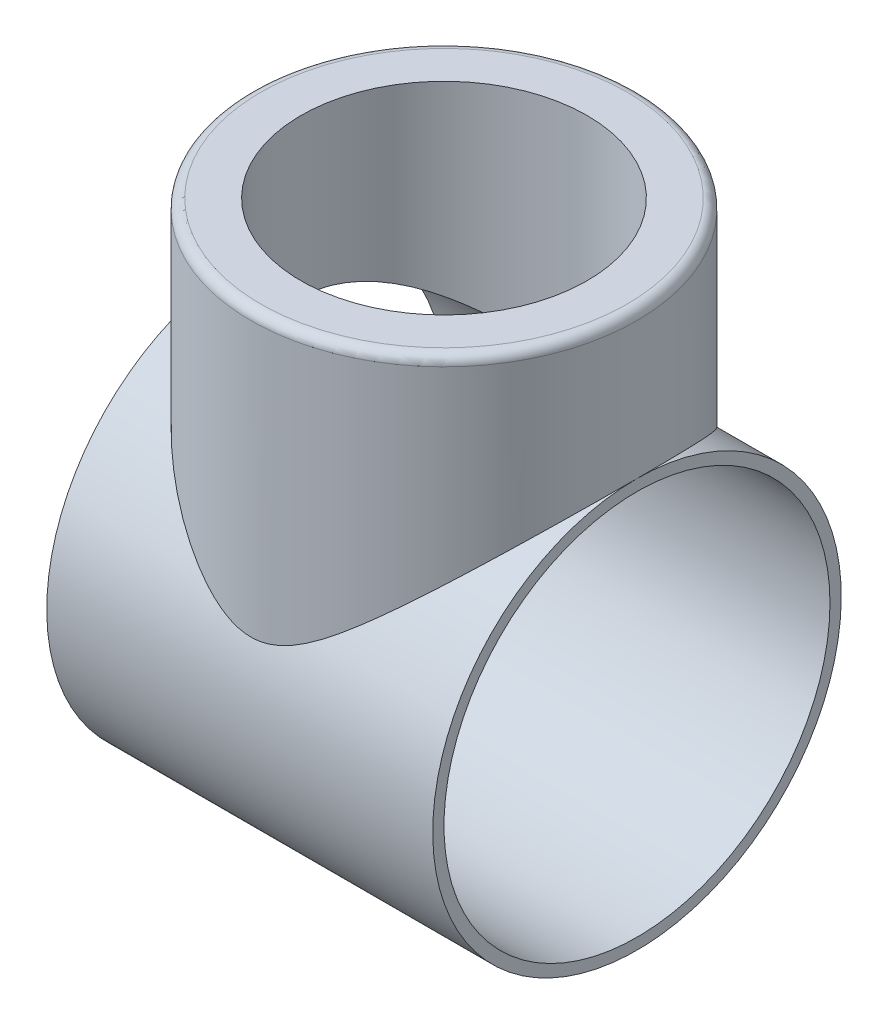
ISO-10303-21;
HEADER;
FILE_DESCRIPTION(('STEP AP214'),'2;1');
FILE_NAME('part.step','',(''),(''),'','','');
FILE_SCHEMA(('AUTOMOTIVE_DESIGN { 1 0 10303 214 1 1 1 1 }'));
ENDSEC;
DATA;
#1=APPLICATION_CONTEXT('core data for automotive mechanical design processes');
#2=APPLICATION_PROTOCOL_DEFINITION('international standard','automotive_design',2000,#1);
#3=PRODUCT_CONTEXT('',#1,'mechanical');
#4=PRODUCT('Part','Part','',(#3));
#5=PRODUCT_RELATED_PRODUCT_CATEGORY('part','',(#4));
#6=PRODUCT_DEFINITION_FORMATION('','',#4);
#7=PRODUCT_DEFINITION_CONTEXT('part definition',#1,'design');
#8=PRODUCT_DEFINITION('design','',#6,#7);
#9=PRODUCT_DEFINITION_SHAPE('','',#8);
#10=(LENGTH_UNIT() NAMED_UNIT(*) SI_UNIT(.MILLI.,.METRE.));
#11=(NAMED_UNIT(*) PLANE_ANGLE_UNIT() SI_UNIT($,.RADIAN.));
#12=(NAMED_UNIT(*) SI_UNIT($,.STERADIAN.) SOLID_ANGLE_UNIT());
#13=UNCERTAINTY_MEASURE_WITH_UNIT(LENGTH_MEASURE(1.E-05),#10,'distance_accuracy_value','');
#14=(GEOMETRIC_REPRESENTATION_CONTEXT(3) GLOBAL_UNCERTAINTY_ASSIGNED_CONTEXT((#13)) GLOBAL_UNIT_ASSIGNED_CONTEXT((#10,
#11,#12)) REPRESENTATION_CONTEXT('',''));
#15=CARTESIAN_POINT('',(0.,0.,0.));
#16=DIRECTION('',(0.,0.,1.));
#17=DIRECTION('',(1.,0.,0.));
#18=AXIS2_PLACEMENT_3D('',#15,#16,#17);
#19=CARTESIAN_POINT('',(-60.,0.,0.));
#20=DIRECTION('',(1.,0.,0.));
#21=DIRECTION('',(0.,0.,-1.));
#22=AXIS2_PLACEMENT_3D('',#19,#20,#21);
#23=CYLINDRICAL_SURFACE('',#22,60.);
#24=CARTESIAN_POINT('',(60.,0.,0.));
#25=DIRECTION('',(1.,0.,0.));
#26=DIRECTION('',(0.,0.,-1.));
#27=AXIS2_PLACEMENT_3D('',#24,#25,#26);
#28=CIRCLE('',#27,60.);
#29=CARTESIAN_POINT('',(60.,0.,-60.));
#30=VERTEX_POINT('',#29);
#31=EDGE_CURVE('E52',#30,#30,#28,.T.);
#32=ORIENTED_EDGE('',*,*,#31,.T.);
#33=EDGE_LOOP('',(#32));
#34=FACE_BOUND('',#33,.T.);
#35=CARTESIAN_POINT('',(-60.,0.,0.));
#36=DIRECTION('',(1.,0.,0.));
#37=DIRECTION('',(0.,0.,-1.));
#38=AXIS2_PLACEMENT_3D('',#35,#36,#37);
#39=CIRCLE('',#38,60.);
#40=CARTESIAN_POINT('',(-60.,0.,-60.));
#41=VERTEX_POINT('',#40);
#42=EDGE_CURVE('E93',#41,#41,#39,.T.);
#43=ORIENTED_EDGE('',*,*,#42,.F.);
#44=EDGE_LOOP('',(#43));
#45=FACE_BOUND('',#44,.T.);
#46=CARTESIAN_POINT('',(0.,40.2461178252015,-44.5));
#47=CARTESIAN_POINT('',(0.521950340710105,40.2461091874401,-44.5000042882494));
#48=CARTESIAN_POINT('',(1.04383948497891,40.2562813467974,-44.4908134860222));
#49=CARTESIAN_POINT('',(2.08624468800879,40.29679076695,-44.4541277588759));
#50=CARTESIAN_POINT('',(2.60676066855394,40.3271291525426,-44.4266318129637));
#51=CARTESIAN_POINT('',(3.64504853630487,40.4075295655595,-44.353517329002));
#52=CARTESIAN_POINT('',(4.16282007227801,40.4575940585679,-44.3078965255041));
#53=CARTESIAN_POINT('',(5.19431452475009,40.5766947814115,-44.1988491619566));
#54=CARTESIAN_POINT('',(5.70803686242041,40.6457336747779,-44.1354201020462));
#55=CARTESIAN_POINT('',(7.24359513295137,40.8802693471307,-43.9186705620038));
#56=CARTESIAN_POINT('',(8.25776608674282,41.0730198952663,-43.7390345051422));
#57=CARTESIAN_POINT('',(10.257564643931,41.5212745320888,-43.3137226483211));
#58=CARTESIAN_POINT('',(11.2431912015059,41.7767809168073,-43.068044432063));
#59=CARTESIAN_POINT('',(13.1683910438996,42.3357936145265,-42.5186066248349));
#60=CARTESIAN_POINT('',(14.1084079437203,42.6386010337178,-42.2156810096681));
#61=CARTESIAN_POINT('',(15.9539269275721,43.2842945061565,-41.5533826240879));
#62=CARTESIAN_POINT('',(16.8594298899541,43.627179538558,-41.1940112913641));
#63=CARTESIAN_POINT('',(18.6345171116782,44.3433852758225,-40.4220393745185));
#64=CARTESIAN_POINT('',(19.5041118289542,44.7166970236494,-40.009454434771));
#65=CARTESIAN_POINT('',(21.2071478906121,45.4853354810806,-39.1334121551078));
#66=CARTESIAN_POINT('',(22.0405865870086,45.8806637983028,-38.6699510978862));
#67=CARTESIAN_POINT('',(23.8366942513597,46.767617311318,-37.5948011891203));
#68=CARTESIAN_POINT('',(24.7912022086411,47.2624844601025,-36.9721303467494));
#69=CARTESIAN_POINT('',(26.6465675245206,48.261565680328,-35.6581377576236));
#70=CARTESIAN_POINT('',(27.5474205383753,48.7657805043797,-34.9668104634265));
#71=CARTESIAN_POINT('',(29.2952372557201,49.7739969690618,-33.5161235927462));
#72=CARTESIAN_POINT('',(30.1421256550589,50.2779973773472,-32.756672361943));
#73=CARTESIAN_POINT('',(31.778415864999,51.275700055055,-31.1717762181585));
#74=CARTESIAN_POINT('',(32.5678130326399,51.7694014904457,-30.346325986402));
#75=CARTESIAN_POINT('',(34.2360957924212,52.8334127397948,-28.4608944512654));
#76=CARTESIAN_POINT('',(35.1017938682631,53.3995579491807,-27.3868198685674));
#77=CARTESIAN_POINT('',(36.7388816469887,54.4896567975256,-25.1480955787368));
#78=CARTESIAN_POINT('',(37.5102508272926,55.0136012466809,-23.9834262512978));
#79=CARTESIAN_POINT('',(38.5884296851264,55.7561611927072,-22.1737546625714));
#80=CARTESIAN_POINT('',(38.9344445874246,55.996289592825,-21.5605741567996));
#81=CARTESIAN_POINT('',(39.5992657729467,56.4605628572466,-20.3137179214327));
#82=CARTESIAN_POINT('',(39.9180737273749,56.6847087031497,-19.6800434539945));
#83=CARTESIAN_POINT('',(40.5269396885394,57.1151163559301,-18.3935670488333));
#84=CARTESIAN_POINT('',(40.8170136671901,57.3213880901394,-17.7407760015974));
#85=CARTESIAN_POINT('',(41.367283893526,57.7145139820236,-16.4168180955821));
#86=CARTESIAN_POINT('',(41.6274729718284,57.9013634792897,-15.7456468750289));
#87=CARTESIAN_POINT('',(42.2160536104265,58.3257078564334,-14.1098261539199));
#88=CARTESIAN_POINT('',(42.5291096534308,58.5528683078576,-13.1368990351965));
#89=CARTESIAN_POINT('',(43.0893465453492,58.9610459401474,-11.1628943464204));
#90=CARTESIAN_POINT('',(43.336542803193,59.1420739139977,-10.1618234217544));
#91=CARTESIAN_POINT('',(43.6554372000947,59.3762755689208,-8.6440871772517));
#92=CARTESIAN_POINT('',(43.7530730054295,59.4481102596546,-8.13557560487839));
#93=CARTESIAN_POINT('',(43.9307501982228,59.5789994743003,-7.11392105689515));
#94=CARTESIAN_POINT('',(44.0107948440874,59.6380563650094,-6.60077895735988));
#95=CARTESIAN_POINT('',(44.1530120978249,59.7430847523843,-5.57062792558039));
#96=CARTESIAN_POINT('',(44.2151826797549,59.7890547657069,-5.05361856180834));
#97=CARTESIAN_POINT('',(44.3214117367221,59.8676564997752,-4.01674246446689));
#98=CARTESIAN_POINT('',(44.3654693389796,59.9002875777797,-3.49687559443048));
#99=CARTESIAN_POINT('',(44.4703501236668,59.9779923563319,-1.9318670440071));
#100=CARTESIAN_POINT('',(44.5035602840376,60.0026399674937,-0.88363602968756));
#101=CARTESIAN_POINT('',(44.4958330595716,59.9969100963708,1.21224592845824));
#102=CARTESIAN_POINT('',(44.4548959647422,59.9665328293014,2.25989687453725));
#103=CARTESIAN_POINT('',(44.2995376296408,59.8514519760434,4.34695695359885));
#104=CARTESIAN_POINT('',(44.1851013218437,59.7667372505429,5.38636435239261));
#105=CARTESIAN_POINT('',(43.8844904701222,59.5448422310987,7.44901649884121));
#106=CARTESIAN_POINT('',(43.6983163060761,59.4076622149783,8.47226133205295));
#107=CARTESIAN_POINT('',(43.2641008547636,59.0890127256266,10.4628678346911));
#108=CARTESIAN_POINT('',(43.01826041709,58.9091228962178,11.4309658277476));
#109=CARTESIAN_POINT('',(42.4650233393857,58.5063437246237,13.3401503805873));
#110=CARTESIAN_POINT('',(42.1576284675576,58.2834556176068,14.2812377153866));
#111=CARTESIAN_POINT('',(41.4846675568433,57.7985571326788,16.1320211676757));
#112=CARTESIAN_POINT('',(41.1190966396067,57.5365434740096,17.0417146448432));
#113=CARTESIAN_POINT('',(40.3333455968536,56.9776492982644,18.8260933971558));
#114=CARTESIAN_POINT('',(39.9131622370173,56.6807667162419,19.7007765948666));
#115=CARTESIAN_POINT('',(38.973005458837,56.022499557773,21.5058204330082));
#116=CARTESIAN_POINT('',(38.447145875456,55.6576115664077,22.4318370619908));
#117=CARTESIAN_POINT('',(37.3370135215526,54.8966231580356,24.2346518194598));
#118=CARTESIAN_POINT('',(36.7527371551884,54.5005208199496,25.1114469129235));
#119=CARTESIAN_POINT('',(35.5293085248845,53.6830922067384,26.8145183935474));
#120=CARTESIAN_POINT('',(34.8901161360653,53.2617475573133,27.6407570734165));
#121=CARTESIAN_POINT('',(33.5606121215878,52.4004604406604,29.2406792745826));
#122=CARTESIAN_POINT('',(32.870298061972,51.9605170883568,30.0143602901862));
#123=CARTESIAN_POINT('',(31.3024484369485,50.9818427894829,31.6532889949493));
#124=CARTESIAN_POINT('',(30.4145893453604,50.4405197225372,32.5071389666396));
#125=CARTESIAN_POINT('',(28.5731712452284,49.3520446269879,34.1370213226318));
#126=CARTESIAN_POINT('',(27.6195994067465,48.8048914778322,34.9130384375959));
#127=CARTESIAN_POINT('',(25.6486318538073,47.7171498458324,36.3855978659591));
#128=CARTESIAN_POINT('',(24.6312091197479,47.1765642592419,37.0821061775823));
#129=CARTESIAN_POINT('',(22.5342509045028,46.116418432799,38.3925212205582));
#130=CARTESIAN_POINT('',(21.4547302842137,45.5968532127562,39.006447598487));
#131=CARTESIAN_POINT('',(19.4624345702153,44.6980671169939,40.0305783513116));
#132=CARTESIAN_POINT('',(18.5609538061182,44.3119394783666,40.456726223778));
#133=CARTESIAN_POINT('',(16.7197604126817,43.572807752645,41.2517262412505));
#134=CARTESIAN_POINT('',(15.7800487337206,43.2198028428767,41.6205798094328));
#135=CARTESIAN_POINT('',(13.8656151236316,42.5581977274057,42.296847572139));
#136=CARTESIAN_POINT('',(12.8909619150813,42.249515755869,42.6043753175112));
#137=CARTESIAN_POINT('',(10.9079654832495,41.6872994375876,43.1546536827896));
#138=CARTESIAN_POINT('',(9.89963037601222,41.4337519145739,43.3974197828659));
#139=CARTESIAN_POINT('',(8.04368455823555,41.0339903275956,43.7752515698321));
#140=CARTESIAN_POINT('',(7.20084207288908,40.8765977494339,43.9219324868934));
#141=CARTESIAN_POINT('',(5.50041819802821,40.6115732475786,44.1671019477012));
#142=CARTESIAN_POINT('',(4.64283865424277,40.5039351388694,44.2655964816223));
#143=CARTESIAN_POINT('',(2.91911830773351,40.3427295547646,44.4125677286822));
#144=CARTESIAN_POINT('',(2.05298633650212,40.2891112096413,44.4610914996129));
#145=CARTESIAN_POINT('',(0.317674362643003,40.2380272726962,44.5073296836804));
#146=CARTESIAN_POINT('',(-0.55150568599144,40.2405625321182,44.505043326576));
#147=CARTESIAN_POINT('',(-2.28596227436666,40.3016700196146,44.4497135761221));
#148=CARTESIAN_POINT('',(-3.15123997960492,40.3602242255133,44.3966865068562));
#149=CARTESIAN_POINT('',(-4.87190451576451,40.5308806498048,44.240941803076));
#150=CARTESIAN_POINT('',(-5.72729134396141,40.642982882947,44.1382241548749));
#151=CARTESIAN_POINT('',(-7.4240653876941,40.9165547676885,43.8847377234221));
#152=CARTESIAN_POINT('',(-8.26543150123807,41.0780927929654,43.7339023771944));
#153=CARTESIAN_POINT('',(-9.92893795590823,41.4448438963211,43.3865023518875));
#154=CARTESIAN_POINT('',(-10.7510755777273,41.6500631108678,43.1899312473468));
#155=CARTESIAN_POINT('',(-12.6870807095658,42.1846332622747,42.6690124944642));
#156=CARTESIAN_POINT('',(-13.7908179644599,42.5312978618984,42.3246484503561));
#157=CARTESIAN_POINT('',(-15.9516144607349,43.2801948728189,41.5585305214342));
#158=CARTESIAN_POINT('',(-17.0086544471686,43.6824499289662,41.1367450758049));
#159=CARTESIAN_POINT('',(-19.0755684632273,44.527930076714,40.2200546403792));
#160=CARTESIAN_POINT('',(-20.0853647652594,44.9712193419744,39.7250343695755));
#161=CARTESIAN_POINT('',(-22.0550882608731,45.884808424398,38.6661782679115));
#162=CARTESIAN_POINT('',(-23.0150204412288,46.355105530638,38.1023493373789));
#163=CARTESIAN_POINT('',(-24.9161621372768,47.3273236161702,36.8883376618597));
#164=CARTESIAN_POINT('',(-25.8556469650214,47.8297762042605,36.2358830733489));
#165=CARTESIAN_POINT('',(-27.679910014823,48.8400529111134,34.8622472738526));
#166=CARTESIAN_POINT('',(-28.5646860737176,49.3478772413438,34.1410633481983));
#167=CARTESIAN_POINT('',(-30.2772938766035,50.358584957203,32.6318457992776));
#168=CARTESIAN_POINT('',(-31.1051561867018,50.8614708686789,31.8438485747471));
#169=CARTESIAN_POINT('',(-32.7017712726705,51.853299207555,30.2019087999941));
#170=CARTESIAN_POINT('',(-33.470525540107,52.3422419866083,29.3479679149222));
#171=CARTESIAN_POINT('',(-34.9471366600719,53.2985479551122,27.5732364539518));
#172=CARTESIAN_POINT('',(-35.6548356260329,53.7658538285782,26.6522832808933));
#173=CARTESIAN_POINT('',(-37.0025002306692,54.6688659515999,24.7472453764052));
#174=CARTESIAN_POINT('',(-37.6424632932466,55.1045709991306,23.7631582461808));
#175=CARTESIAN_POINT('',(-38.8486279933934,55.9354535238626,21.7353357344004));
#176=CARTESIAN_POINT('',(-39.4148771427242,56.3306570707044,20.6916394040002));
#177=CARTESIAN_POINT('',(-40.4677394262983,57.0723077490861,18.5482327967657));
#178=CARTESIAN_POINT('',(-40.954366559355,57.4187634497671,17.4485324110101));
#179=CARTESIAN_POINT('',(-41.7734480273411,58.0060562896384,15.3713226943041));
#180=CARTESIAN_POINT('',(-42.1180999819418,58.2549428335656,14.4008872247955));
#181=CARTESIAN_POINT('',(-42.7416054367343,58.7073143426455,12.4287679411175));
#182=CARTESIAN_POINT('',(-43.0204651989122,58.9108036285294,11.4270871111101));
#183=CARTESIAN_POINT('',(-43.5086322607101,59.2682330369469,9.39874524150024));
#184=CARTESIAN_POINT('',(-43.7179750064187,59.4221984100089,8.37209721993441));
#185=CARTESIAN_POINT('',(-44.0642873146111,59.6774471738407,6.30013580032234));
#186=CARTESIAN_POINT('',(-44.2012560659236,59.7787299741415,5.25482219320709));
#187=CARTESIAN_POINT('',(-44.4009995850255,59.9265736105224,3.14995644098688));
#188=CARTESIAN_POINT('',(-44.4635423875705,59.9729633575138,2.09037013500847));
#189=CARTESIAN_POINT('',(-44.5126410521356,60.0093737571475,-0.0315402479794816));
#190=CARTESIAN_POINT('',(-44.49919675987,59.9993942953369,-1.09386433054349));
#191=CARTESIAN_POINT('',(-44.3965384869147,59.9232964064283,-3.21290418427762));
#192=CARTESIAN_POINT('',(-44.3073172142214,59.8571725765695,-4.26961940586038));
#193=CARTESIAN_POINT('',(-44.0545293478902,59.6702967677894,-6.36918090875246));
#194=CARTESIAN_POINT('',(-43.8909640703089,59.5495457558927,-7.41202743523263));
#195=CARTESIAN_POINT('',(-43.5013980468378,59.2630163329123,-9.42773117519935));
#196=CARTESIAN_POINT('',(-43.2786998341044,59.0996258396571,-10.4015717985618));
#197=CARTESIAN_POINT('',(-42.7709367825483,58.7288085972727,-12.3241853536313));
#198=CARTESIAN_POINT('',(-42.4858743947813,58.5213835788113,-13.2729592688756));
#199=CARTESIAN_POINT('',(-41.8566393162162,58.0661784465417,-15.1407765123869));
#200=CARTESIAN_POINT('',(-41.5124612489804,57.818394662301,-16.0598171274347));
#201=CARTESIAN_POINT('',(-40.7685039846635,57.2865888952406,-17.864256334358));
#202=CARTESIAN_POINT('',(-40.3687215084379,57.0025647753105,-18.7496529382301));
#203=CARTESIAN_POINT('',(-39.4756743282588,56.373476215924,-20.5680435948418));
#204=CARTESIAN_POINT('',(-38.9771009809435,56.0251623487047,-21.4973049359076));
#205=CARTESIAN_POINT('',(-37.9216627541991,55.2960838893367,-23.3087229625223));
#206=CARTESIAN_POINT('',(-37.3647947388914,54.9153175516585,-24.1908771101481));
#207=CARTESIAN_POINT('',(-36.196421767278,54.1271171877636,-25.9065023282224));
#208=CARTESIAN_POINT('',(-35.5848840858751,53.7196672283635,-26.7399437390662));
#209=CARTESIAN_POINT('',(-34.3109233963292,52.8843847752664,-28.3561187012408));
#210=CARTESIAN_POINT('',(-33.6484978667809,52.4565512719992,-29.1388497364131));
#211=CARTESIAN_POINT('',(-32.1442957713006,51.5034469314094,-30.797337438415));
#212=CARTESIAN_POINT('',(-31.2924453848203,50.9751879296599,-31.6622617350211));
#213=CARTESIAN_POINT('',(-29.5241829089023,49.9092126334412,-33.3172559849402));
#214=CARTESIAN_POINT('',(-28.6077594512591,49.3714946862736,-34.1073126999826));
#215=CARTESIAN_POINT('',(-26.7122623392538,48.297870061859,-35.6113733885586));
#216=CARTESIAN_POINT('',(-25.7331462834457,47.7619648741604,-36.3253250006942));
#217=CARTESIAN_POINT('',(-23.7143783853228,46.7052659315094,-37.6742851619448));
#218=CARTESIAN_POINT('',(-22.6747375816564,46.184469446795,-38.3093080404504));
#219=CARTESIAN_POINT('',(-20.7074274646056,45.2539753190545,-39.4018648234355));
#220=CARTESIAN_POINT('',(-19.7885739385137,44.8398636275907,-39.8715266699809));
#221=CARTESIAN_POINT('',(-17.9091303612557,44.0427382109742,-40.7503257680393));
#222=CARTESIAN_POINT('',(-16.9485395648822,43.6597250414274,-41.1594619383084));
#223=CARTESIAN_POINT('',(-14.9886766513092,42.9369595143049,-41.9128813803387));
#224=CARTESIAN_POINT('',(-13.9894816994186,42.5971261433523,-42.2572866992272));
#225=CARTESIAN_POINT('',(-11.9533246844578,41.972544556354,-42.877728409414));
#226=CARTESIAN_POINT('',(-10.9163746735275,41.6877789416741,-43.1537864027726));
#227=CARTESIAN_POINT('',(-9.06795056486468,41.2478015067845,-43.5739296071159));
#228=CARTESIAN_POINT('',(-8.26352200117434,41.0779436302794,-43.7337772467831));
#229=CARTESIAN_POINT('',(-6.63919931287222,40.7822487862483,-44.0096492737428));
#230=CARTESIAN_POINT('',(-5.8193077359748,40.6564046325783,-44.1256808151597));
#231=CARTESIAN_POINT('',(-4.16918296146037,40.4532122182416,-44.3120376887577));
#232=CARTESIAN_POINT('',(-3.33896078214854,40.375816164653,-44.3824080671271));
#233=CARTESIAN_POINT('',(-1.6724406360641,40.2722721227382,-44.4763892223377));
#234=CARTESIAN_POINT('',(-0.836141794890599,40.2461316625205,-44.4999931304106));
#235=CARTESIAN_POINT('',(0.,40.2461178252015,-44.5));
#236=B_SPLINE_CURVE_WITH_KNOTS('',3,(#46,#47,#48,#49,#50,#51,#52,#53,#54,#55,#56,#57,#58,#59,
#60,#61,#62,#63,#64,#65,#66,#67,#68,#69,#70,#71,#72,#73,#74,#75,#76,#77,#78,#79,#80,#81,#82,#83,
#84,#85,#86,#87,#88,#89,#90,#91,#92,#93,#94,#95,#96,#97,#98,#99,#100,#101,#102,#103,#104,#105,
#106,#107,#108,#109,#110,#111,#112,#113,#114,#115,#116,#117,#118,#119,#120,#121,#122,#123,#124,
#125,#126,#127,#128,#129,#130,#131,#132,#133,#134,#135,#136,#137,#138,#139,#140,#141,#142,#143,
#144,#145,#146,#147,#148,#149,#150,#151,#152,#153,#154,#155,#156,#157,#158,#159,#160,#161,#162,
#163,#164,#165,#166,#167,#168,#169,#170,#171,#172,#173,#174,#175,#176,#177,#178,#179,#180,#181,
#182,#183,#184,#185,#186,#187,#188,#189,#190,#191,#192,#193,#194,#195,#196,#197,#198,#199,#200,
#201,#202,#203,#204,#205,#206,#207,#208,#209,#210,#211,#212,#213,#214,#215,#216,#217,#218,#219,
#220,#221,#222,#223,#224,#225,#226,#227,#228,#229,#230,#231,#232,#233,#234,#235),.UNSPECIFIED.,
.T.,.F.,(4,2,2,2,2,2,2,2,2,2,2,2,2,2,2,2,2,2,2,2,2,2,2,2,2,2,2,2,2,2,2,2,2,2,2,2,2,2,2,2,2,2,2,
2,2,2,2,2,2,2,2,2,2,2,2,2,2,2,2,2,2,2,2,2,2,2,2,2,2,2,2,2,2,2,2,2,2,2,2,2,2,2,2,2,2,2,2,2,2,2,2,
2,2,2,4),(0.,1.56556517147146,3.13121767169813,4.69706592637481,6.26313409934394,
9.40144702949159,12.5398747973961,15.6356864170503,18.7314191982175,21.826243924496,
24.9212949274269,28.6453743115329,32.3697548465043,36.099223572733,39.8289931555986,
44.2965662154786,48.7651095360273,50.9960052618935,53.2267638547709,55.4562754288435,
57.6863207501565,60.823899258746,63.9607430356961,65.5286258562801,67.0962180130722,
68.6639877792385,70.2318330800318,73.3745578864826,76.5172704010164,79.660627385307,
82.8039677245902,85.8454248664966,88.8867946525303,91.9284196070492,94.9702247782702,
98.3440535849777,101.718090195545,105.09461339013,108.471297448081,112.503760025058,
116.53701215405,120.57198268409,124.605991574121,127.81141806161,131.016764914371,
134.216120486931,137.4147106213,140.021682558505,142.62833033385,145.23252116116,
147.836751465953,150.440144230556,153.04353771224,155.650548295344,158.257925361325,
161.873592564132,165.490736979422,169.113637051068,172.736174106099,176.48094468703,
180.225863240111,183.968754575554,187.71155142972,191.463753733026,195.216098686979,
198.966012991889,202.715267292296,205.890427517031,209.065285413528,212.238521984498,
215.411794120498,218.594930785149,221.778073912902,224.961523388583,228.144916512222,
231.17841403459,234.211792354927,237.245446700401,240.279280024709,243.607858112388,
246.936615348285,250.267378683901,253.598307159686,257.566177425562,261.534747995964,
265.506031612056,269.476593191306,272.809775718956,276.14301778413,279.46991070141,
282.795750764736,285.306240089339,287.816319333457,290.323918524506,292.831885988828),.UNSPECIFIED.);
#237=CARTESIAN_POINT('',(0.,40.2461178252015,-44.5));
#238=VERTEX_POINT('',#237);
#239=EDGE_CURVE('E21',#238,#238,#236,.T.);
#240=ORIENTED_EDGE('',*,*,#239,.F.);
#241=EDGE_LOOP('',(#240));
#242=FACE_BOUND('',#241,.T.);
#243=ADVANCED_FACE('F16',(#34,#45,#242),#23,.F.);
#244=CARTESIAN_POINT('',(0.,0.,0.));
#245=DIRECTION('',(0.,-1.,0.));
#246=DIRECTION('',(0.,0.,-1.));
#247=AXIS2_PLACEMENT_3D('',#244,#245,#246);
#248=CYLINDRICAL_SURFACE('',#247,60.);
#249=CARTESIAN_POINT('',(0.,106.,0.));
#250=DIRECTION('',(0.,-1.,0.));
#251=DIRECTION('',(0.,0.,-1.));
#252=AXIS2_PLACEMENT_3D('',#249,#250,#251);
#253=CIRCLE('',#252,60.);
#254=CARTESIAN_POINT('',(0.,106.,-60.));
#255=VERTEX_POINT('',#254);
#256=EDGE_CURVE('E11',#255,#255,#253,.T.);
#257=ORIENTED_EDGE('',*,*,#256,.T.);
#258=EDGE_LOOP('',(#257));
#259=FACE_BOUND('',#258,.T.);
#260=CARTESIAN_POINT('',(0.,20.7906228862918,-60.));
#261=CARTESIAN_POINT('',(0.758528909390587,20.7906687322399,-59.9999904065511));
#262=CARTESIAN_POINT('',(1.51729366262084,20.8324790088875,-59.98554699321));
#263=CARTESIAN_POINT('',(3.02541119739763,20.9961734248151,-59.9284381571005));
#264=CARTESIAN_POINT('',(3.77475470966428,21.1181309601118,-59.8857468656814));
#265=CARTESIAN_POINT('',(5.26008636130046,21.4333476508569,-59.7736517022794));
#266=CARTESIAN_POINT('',(5.99598309437329,21.6269798770012,-59.7041079787402));
#267=CARTESIAN_POINT('',(7.44660432062503,22.0731706531462,-59.5405851678695));
#268=CARTESIAN_POINT('',(8.16132786930634,22.3257318274138,-59.4466049922948));
#269=CARTESIAN_POINT('',(9.41850242889429,22.8188288099898,-59.2587975120337));
#270=CARTESIAN_POINT('',(9.96516431764428,23.0504265040595,-59.1692185698772));
#271=CARTESIAN_POINT('',(11.0454442017346,23.5376156349974,-58.9771073554713));
#272=CARTESIAN_POINT('',(11.5790596845841,23.7932116483219,-58.8745726112687));
#273=CARTESIAN_POINT('',(12.6342055594526,24.3241678903389,-58.6572009071734));
#274=CARTESIAN_POINT('',(13.1557274926231,24.5995414317841,-58.5423556346522));
#275=CARTESIAN_POINT('',(14.1871816507752,25.166256868166,-58.3009810156804));
#276=CARTESIAN_POINT('',(14.6971145190673,25.4575978736686,-58.1744523197619));
#277=CARTESIAN_POINT('',(15.7078218450643,26.0541498508793,-57.9097406057808));
#278=CARTESIAN_POINT('',(16.2085648488496,26.3593992025115,-57.7715243095543));
#279=CARTESIAN_POINT('',(17.2002231418555,26.980521261027,-57.4840737539756));
#280=CARTESIAN_POINT('',(17.6911376592914,27.2963947969985,-57.3348386336471));
#281=CARTESIAN_POINT('',(19.1499499190291,28.2565531409301,-56.8710945910735));
#282=CARTESIAN_POINT('',(20.1043443165854,28.9136328016263,-56.5404340934388));
#283=CARTESIAN_POINT('',(22.0039769964669,30.2649996523406,-55.8290004142343));
#284=CARTESIAN_POINT('',(22.9484730965435,30.9597983411099,-55.4472322243461));
#285=CARTESIAN_POINT('',(24.8087273501631,32.3627900030287,-54.640232118589));
#286=CARTESIAN_POINT('',(25.7244808693601,33.0709851069629,-54.2149932402454));
#287=CARTESIAN_POINT('',(27.5301587030445,34.4942177445593,-53.3207838963083));
#288=CARTESIAN_POINT('',(28.4200632243271,35.2092599917402,-52.8517810198544));
#289=CARTESIAN_POINT('',(30.1746375527395,36.6401586498467,-51.8700459354968));
#290=CARTESIAN_POINT('',(31.0393088329444,37.3560150107006,-51.3573162871723));
#291=CARTESIAN_POINT('',(32.7428121268253,38.7830613774666,-50.2883478998282));
#292=CARTESIAN_POINT('',(33.5816780939988,39.4942564530126,-49.7321700686894));
#293=CARTESIAN_POINT('',(35.234669982534,40.9090380230505,-48.5750536608696));
#294=CARTESIAN_POINT('',(36.0487951337687,41.6126242802584,-47.9741136928473));
#295=CARTESIAN_POINT('',(37.6510954118819,43.0081407004995,-46.7271330486956));
#296=CARTESIAN_POINT('',(38.4392848277944,43.7000771756526,-46.0811178399591));
#297=CARTESIAN_POINT('',(39.9888399141275,45.0691221589826,-44.7430488200409));
#298=CARTESIAN_POINT('',(40.7502076319229,45.7462317974337,-44.0509985345428));
#299=CARTESIAN_POINT('',(42.5829204522391,47.3847886646905,-42.2960309164036));
#300=CARTESIAN_POINT('',(43.6385274405875,48.3361625708875,-41.2070707142414));
#301=CARTESIAN_POINT('',(45.6828552063846,50.1895163052427,-38.9283808789139));
#302=CARTESIAN_POINT('',(46.6715760592437,51.0914961890899,-37.7386513593641));
#303=CARTESIAN_POINT('',(48.0968489136662,52.397719369308,-35.8789928350597));
#304=CARTESIAN_POINT('',(48.5620560600246,52.8251053584278,-35.2469780635364));
#305=CARTESIAN_POINT('',(49.4722030615757,53.6629970827709,-33.9576752372917));
#306=CARTESIAN_POINT('',(49.9171443182551,54.0735039850751,-33.3003889360368));
#307=CARTESIAN_POINT('',(50.785239676417,54.8758885887138,-31.9608542168824));
#308=CARTESIAN_POINT('',(51.2084000426182,55.2677716442079,-31.2786130742796));
#309=CARTESIAN_POINT('',(52.0316481010739,56.0314086794391,-29.8891272744113));
#310=CARTESIAN_POINT('',(52.4317299163567,56.4031575305253,-29.1818763216913));
#311=CARTESIAN_POINT('',(53.4326006917372,57.3344775183045,-27.3244873901495));
#312=CARTESIAN_POINT('',(54.0148396806077,57.8775849365436,-26.1559284749153));
#313=CARTESIAN_POINT('',(55.1104563481879,58.9013953354424,-23.7606996871457));
#314=CARTESIAN_POINT('',(55.623849737572,59.3821125528359,-22.5340431593334));
#315=CARTESIAN_POINT('',(56.3369569822265,60.0507779860611,-20.6542203035782));
#316=CARTESIAN_POINT('',(56.5651646691798,60.2649336682026,-20.0209651192068));
#317=CARTESIAN_POINT('',(57.001741284094,60.6748948739397,-18.7418762661228));
#318=CARTESIAN_POINT('',(57.2101134658845,60.8707034071312,-18.0960446814612));
#319=CARTESIAN_POINT('',(57.6062016973035,61.2431214762665,-16.7925461809546));
#320=CARTESIAN_POINT('',(57.7939157959858,61.4197291988699,-16.1348781540904));
#321=CARTESIAN_POINT('',(58.1478526247792,61.7528881498504,-14.8087211107725));
#322=CARTESIAN_POINT('',(58.3140744128745,61.9094384991028,-14.1402316214542));
#323=CARTESIAN_POINT('',(58.6254299614442,62.2027997497841,-12.7884212341209));
#324=CARTESIAN_POINT('',(58.7703922744052,62.3394501114345,-12.1050259204838));
#325=CARTESIAN_POINT('',(59.0369866822571,62.5908445998107,-10.7296289567849));
#326=CARTESIAN_POINT('',(59.1586165304059,62.7055866169215,-10.037626484743));
#327=CARTESIAN_POINT('',(59.3778914230342,62.9125001293602,-8.64649196407175));
#328=CARTESIAN_POINT('',(59.475537005446,63.0046721309006,-7.9473600757112));
#329=CARTESIAN_POINT('',(59.6463168139495,63.165911038749,-6.54346262801519));
#330=CARTESIAN_POINT('',(59.7194513133625,63.2349782026974,-5.83869713158943));
#331=CARTESIAN_POINT('',(59.8407758047187,63.3495702561386,-4.42541956584605));
#332=CARTESIAN_POINT('',(59.8889765473168,63.3951052919398,-3.716909244522));
#333=CARTESIAN_POINT('',(59.9602033516643,63.4623971368019,-2.29757972319877));
#334=CARTESIAN_POINT('',(59.9832322842367,63.4841566574395,-1.58676079577034));
#335=CARTESIAN_POINT('',(60.0039892025269,63.5037692257477,-0.164433052004176));
#336=CARTESIAN_POINT('',(60.0017179853667,63.5016230266065,0.547075741891947));
#337=CARTESIAN_POINT('',(59.9719010196848,63.4734503428098,1.96902100026199));
#338=CARTESIAN_POINT('',(59.9443559975306,63.4474245444525,2.67945749496598));
#339=CARTESIAN_POINT('',(59.8337650199722,63.3429462153451,4.63417148601373));
#340=CARTESIAN_POINT('',(59.7244990534306,63.2397297181741,5.87582573496755));
#341=CARTESIAN_POINT('',(59.4302796460327,62.9619393948515,8.34172373501794));
#342=CARTESIAN_POINT('',(59.2453336712804,62.7873726076638,9.56596919122999));
#343=CARTESIAN_POINT('',(58.8027968147367,62.3699728081123,11.989514771222));
#344=CARTESIAN_POINT('',(58.5451991013245,62.1271333759116,13.1888125377168));
#345=CARTESIAN_POINT('',(57.961305301611,61.5772140343237,15.5554813630102));
#346=CARTESIAN_POINT('',(57.6350054065378,61.2701305633253,16.722850647674));
#347=CARTESIAN_POINT('',(56.9088702964539,60.5875710834974,19.050065571891));
#348=CARTESIAN_POINT('',(56.507334178709,60.2105155945908,20.2089148761408));
#349=CARTESIAN_POINT('',(55.6419501166776,59.3991076301619,22.4822789702302));
#350=CARTESIAN_POINT('',(55.1781030216677,58.9647559355682,23.5967943640572));
#351=CARTESIAN_POINT('',(54.1933504392047,58.0442814595975,25.7781503739198));
#352=CARTESIAN_POINT('',(53.6724420871035,57.5581560790584,26.8449885926276));
#353=CARTESIAN_POINT('',(52.5785531216232,56.5394950047237,28.9288943388254));
#354=CARTESIAN_POINT('',(52.0055613586887,56.0069493746984,29.94595113752));
#355=CARTESIAN_POINT('',(50.9564836787026,55.0343933635614,31.6892273695647));
#356=CARTESIAN_POINT('',(50.4903989534606,54.6030819626321,32.4263828230759));
#357=CARTESIAN_POINT('',(49.5330968526136,53.7191212703474,33.870678097755));
#358=CARTESIAN_POINT('',(49.0418837011452,53.2664755663289,34.5778229274382));
#359=CARTESIAN_POINT('',(47.5326431796392,51.8791349918499,36.6548496992369));
#360=CARTESIAN_POINT('',(46.4792485157517,50.915253822379,37.9799383317709));
#361=CARTESIAN_POINT('',(44.2876354690731,48.9227510920271,40.5144742737073));
#362=CARTESIAN_POINT('',(43.1491544240426,47.8939307220679,41.7235347598777));
#363=CARTESIAN_POINT('',(40.799815617742,45.7886694310987,44.0235959738365));
#364=CARTESIAN_POINT('',(39.5889676055663,44.7122349295989,45.1146125487972));
#365=CARTESIAN_POINT('',(37.5566358288247,42.925635713006,46.8033174342971));
#366=CARTESIAN_POINT('',(36.7546948944416,42.225483667487,47.4355079174354));
#367=CARTESIAN_POINT('',(35.1253194151573,40.8150874837224,48.6543643005233));
#368=CARTESIAN_POINT('',(34.2978833639616,40.1048427505247,49.2410275034114));
#369=CARTESIAN_POINT('',(32.6175047511009,38.6775738556822,50.3698696624441));
#370=CARTESIAN_POINT('',(31.7645426975343,37.9605448147293,50.9120133759927));
#371=CARTESIAN_POINT('',(30.0336692030098,36.5244804865607,51.9518821652084));
#372=CARTESIAN_POINT('',(29.155758762104,35.8054452808009,52.4496090180162));
#373=CARTESIAN_POINT('',(27.3763991281173,34.3720787220823,53.3998838019665));
#374=CARTESIAN_POINT('',(26.4750155378331,33.6577400546386,53.852543505548));
#375=CARTESIAN_POINT('',(24.6447075201963,32.237829488663,54.7143663452147));
#376=CARTESIAN_POINT('',(23.7157797059046,31.532258683524,55.1235241035372));
#377=CARTESIAN_POINT('',(21.8287917760074,30.138706864775,55.8976090636547));
#378=CARTESIAN_POINT('',(20.8707704289991,29.4507045136316,56.2625921516717));
#379=CARTESIAN_POINT('',(18.9203529914622,28.1021712098136,56.9481250825322));
#380=CARTESIAN_POINT('',(17.9279688275069,27.4416308974152,57.2686901524572));
#381=CARTESIAN_POINT('',(16.2347758220797,26.3731023134669,57.7662059172242));
#382=CARTESIAN_POINT('',(15.5451042326864,25.9533452186927,57.9557727293178));
#383=CARTESIAN_POINT('',(14.145000998825,25.1397301303381,58.3133016256247));
#384=CARTESIAN_POINT('',(13.4345684860103,24.7458732223051,58.4812628045688));
#385=CARTESIAN_POINT('',(11.9915601861318,23.993105210065,58.794105374896));
#386=CARTESIAN_POINT('',(11.2590148117499,23.6341487403093,58.9390168877664));
#387=CARTESIAN_POINT('',(9.76890030891742,22.9617010121501,59.2042300029197));
#388=CARTESIAN_POINT('',(9.01133819327823,22.6481971428825,59.3245384351666));
#389=CARTESIAN_POINT('',(7.66394620885365,22.1517197827822,59.5113698196047));
#390=CARTESIAN_POINT('',(7.07975187207299,21.9557353810002,59.583813090906));
#391=CARTESIAN_POINT('',(5.89778570076965,21.6036089820242,59.7123876813954));
#392=CARTESIAN_POINT('',(5.30001891891906,21.4474524144445,59.7685249669181));
#393=CARTESIAN_POINT('',(4.09422584327693,21.1817843970081,59.8631939386489));
#394=CARTESIAN_POINT('',(3.4862280029898,21.0721605455251,59.9017680659426));
#395=CARTESIAN_POINT('',(2.26220406470628,20.9045528992181,59.9604675581135));
#396=CARTESIAN_POINT('',(1.64617858093479,20.8465651767879,59.9805943261582));
#397=CARTESIAN_POINT('',(0.406796236364865,20.7853299263221,60.0018431849288));
#398=CARTESIAN_POINT('',(-0.21658193180487,20.782460444376,60.0028340260279));
#399=CARTESIAN_POINT('',(-1.46078189065839,20.8326035275548,59.985442278827));
#400=CARTESIAN_POINT('',(-2.08160363194148,20.8856171675315,59.9670593178927));
#401=CARTESIAN_POINT('',(-3.31671831080052,21.0445852806879,59.9114546959283));
#402=CARTESIAN_POINT('',(-3.93099594436179,21.1506440349662,59.8741959251749));
#403=CARTESIAN_POINT('',(-5.14799615984707,21.4102311635758,59.7818607643608));
#404=CARTESIAN_POINT('',(-5.7507166496707,21.5637680479414,59.7267811799951));
#405=CARTESIAN_POINT('',(-7.22135694427491,21.9931303830577,59.5703433546844));
#406=CARTESIAN_POINT('',(-8.08135503699839,22.2925568468197,59.459390890244));
#407=CARTESIAN_POINT('',(-9.76992230889682,22.9586099987819,59.2053970578338));
#408=CARTESIAN_POINT('',(-10.5984702437983,23.3252811683373,59.0623344353738));
#409=CARTESIAN_POINT('',(-12.2287783127481,24.1097614729603,58.746479888434));
#410=CARTESIAN_POINT('',(-13.0304255363341,24.5277583980892,58.5735777926153));
#411=CARTESIAN_POINT('',(-14.606629561452,25.4002579302588,58.2005340027037));
#412=CARTESIAN_POINT('',(-15.381190805212,25.8547545104959,58.000396801882));
#413=CARTESIAN_POINT('',(-17.0118428044231,26.8548428987068,57.5448468491374));
#414=CARTESIAN_POINT('',(-17.8644479805037,27.4043540722059,57.2856174903084));
#415=CARTESIAN_POINT('',(-19.543279473811,28.527194033868,56.7348277230435));
#416=CARTESIAN_POINT('',(-20.3694992682183,29.1005286321142,56.4432593984596));
#417=CARTESIAN_POINT('',(-21.9992618422014,30.2637023339719,55.8282333428868));
#418=CARTESIAN_POINT('',(-22.8027836810337,30.8535557389622,55.5047473265184));
#419=CARTESIAN_POINT('',(-24.3886372665535,32.0434251983279,54.8264349792148));
#420=CARTESIAN_POINT('',(-25.1709707940348,32.643440391713,54.4716112928341));
#421=CARTESIAN_POINT('',(-26.7172922178668,33.8501069518441,53.730090001806));
#422=CARTESIAN_POINT('',(-27.4812507569071,34.4567669411775,53.3433452676084));
#423=CARTESIAN_POINT('',(-28.9906404962924,35.6722178063826,52.5383127204357));
#424=CARTESIAN_POINT('',(-29.7360714479202,36.281008710735,52.1200244843195));
#425=CARTESIAN_POINT('',(-31.2086452758759,37.4974332369504,51.2518358260864));
#426=CARTESIAN_POINT('',(-31.9357955085427,38.1050672303482,50.8019484055169));
#427=CARTESIAN_POINT('',(-33.3722766591617,39.3167920231314,49.870072085474));
#428=CARTESIAN_POINT('',(-34.0816073882599,39.9208827849132,49.3880828459779));
#429=CARTESIAN_POINT('',(-35.562129203882,41.191683200239,48.3347883914542));
#430=CARTESIAN_POINT('',(-36.331151920835,41.8576791485035,47.7595654971656));
#431=CARTESIAN_POINT('',(-37.8461742604983,43.1792288351404,46.5681837635291));
#432=CARTESIAN_POINT('',(-38.5921734204128,43.834782363482,45.9520241020963));
#433=CARTESIAN_POINT('',(-40.0603124376432,45.132703448277,44.6779183477359));
#434=CARTESIAN_POINT('',(-40.782443206548,45.7750659474892,44.0199566101737));
#435=CARTESIAN_POINT('',(-42.201053362428,47.0433627335256,42.661871342333));
#436=CARTESIAN_POINT('',(-42.8975331462097,47.6692972744381,41.9617484647058));
#437=CARTESIAN_POINT('',(-44.2609049256129,48.8998143820474,40.5210175073272));
#438=CARTESIAN_POINT('',(-44.9278811753656,49.5044565887796,39.7805402872031));
#439=CARTESIAN_POINT('',(-46.2323436227258,50.6912847640404,38.2567162942638));
#440=CARTESIAN_POINT('',(-46.8698286547504,51.2734698448442,37.4733678297131));
#441=CARTESIAN_POINT('',(-48.1123681622239,52.4117157514376,35.864087050533));
#442=CARTESIAN_POINT('',(-48.7174420608969,52.9677921982708,35.0381808354609));
#443=CARTESIAN_POINT('',(-49.8925851930702,54.0506056360251,33.3435603311628));
#444=CARTESIAN_POINT('',(-50.4626596112058,54.5773469714132,32.474852416884));
#445=CARTESIAN_POINT('',(-51.6999340537438,55.7231195826794,30.476480117449));
#446=CARTESIAN_POINT('',(-52.3566644086509,56.3331017236956,29.3350678509573));
#447=CARTESIAN_POINT('',(-53.6041104557303,57.4943370151523,26.9882327473561));
#448=CARTESIAN_POINT('',(-54.1948377861362,58.0456005185765,25.782821250626));
#449=CARTESIAN_POINT('',(-55.3028391398836,59.0814298893703,23.3115648644228));
#450=CARTESIAN_POINT('',(-55.82014000171,59.5660201248308,22.0457422833469));
#451=CARTESIAN_POINT('',(-56.7739730326628,60.4607864226878,19.4580612763681));
#452=CARTESIAN_POINT('',(-57.2105026371027,60.8709601221678,18.1362010727702));
#453=CARTESIAN_POINT('',(-57.8007267910454,61.4261308181702,16.1113950707765));
#454=CARTESIAN_POINT('',(-57.9874127712145,61.6018391117936,15.4262120958629));
#455=CARTESIAN_POINT('',(-58.3374041299346,61.9314075349646,14.0447392458252));
#456=CARTESIAN_POINT('',(-58.5007123385065,62.0852703090262,13.348450726456));
#457=CARTESIAN_POINT('',(-58.8031402422415,62.37031948222,11.9459393581317));
#458=CARTESIAN_POINT('',(-58.9422563834057,62.5015025495141,11.2397150659805));
#459=CARTESIAN_POINT('',(-59.1955130783151,62.740393688889,9.81895124098046));
#460=CARTESIAN_POINT('',(-59.3096568654099,62.848104800045,9.1044127972569));
#461=CARTESIAN_POINT('',(-59.5122928987245,63.0393677528273,7.66890692232725));
#462=CARTESIAN_POINT('',(-59.600799500843,63.1229331151367,6.94794332303389));
#463=CARTESIAN_POINT('',(-59.7517239443748,63.2654558007023,5.50095812532444));
#464=CARTESIAN_POINT('',(-59.8141451118529,63.3244162612443,4.77493718376204));
#465=CARTESIAN_POINT('',(-59.9125411076332,63.4173660881438,3.31954284305952));
#466=CARTESIAN_POINT('',(-59.948517092367,63.4513565464241,2.59016959191755));
#467=CARTESIAN_POINT('',(-59.9938077638634,63.4941486592253,1.12987181716076));
#468=CARTESIAN_POINT('',(-60.0031233492999,63.5029511627869,0.398947346665935));
#469=CARTESIAN_POINT('',(-59.9955648266933,63.4958093154703,-0.967958496528806));
#470=CARTESIAN_POINT('',(-59.9819259055395,63.4829219168062,-1.6039778243444));
#471=CARTESIAN_POINT('',(-59.9344696401623,63.4380847001962,-2.87464688972412));
#472=CARTESIAN_POINT('',(-59.9006505868162,63.4061332676538,-3.50929650671317));
#473=CARTESIAN_POINT('',(-59.8129923027164,63.3233277660118,-4.77585322987539));
#474=CARTESIAN_POINT('',(-59.7591570784979,63.2724774798005,-5.40776085930724));
#475=CARTESIAN_POINT('',(-59.6317156906658,63.1521265361285,-6.66781363904767));
#476=CARTESIAN_POINT('',(-59.5581075644902,63.0826240273395,-7.29595840954292));
#477=CARTESIAN_POINT('',(-59.3080827836329,62.8466036531325,-9.17297148525979));
#478=CARTESIAN_POINT('',(-59.1024447948381,62.6525531478352,-10.4147182262867));
#479=CARTESIAN_POINT('',(-58.6167591889885,62.1945973466314,-12.8702342859526));
#480=CARTESIAN_POINT('',(-58.3367086016048,61.9306892622204,-14.0840024856694));
#481=CARTESIAN_POINT('',(-57.7100015478257,61.3407142955875,-16.463685618724));
#482=CARTESIAN_POINT('',(-57.3641083663049,61.015360042641,-17.6299791201628));
#483=CARTESIAN_POINT('',(-56.608553678171,60.3055684631369,-19.9230807615385));
#484=CARTESIAN_POINT('',(-56.1988947678094,59.9211335420845,-21.0498905067877));
#485=CARTESIAN_POINT('',(-55.3207434138154,59.0983173899384,-23.2600440438987));
#486=CARTESIAN_POINT('',(-54.8522455668947,58.6599312044746,-24.3433838317625));
#487=CARTESIAN_POINT('',(-53.861285669114,57.7343636462477,-26.4637822601103));
#488=CARTESIAN_POINT('',(-53.3388122451558,57.2471719904283,-27.500831080513));
#489=CARTESIAN_POINT('',(-52.3889698406638,56.3633957674972,-29.259436424528));
#490=CARTESIAN_POINT('',(-51.9728151953931,55.9767610641628,-29.9921232903096));
#491=CARTESIAN_POINT('',(-51.1157596421068,55.1819284837638,-31.4305576832213));
#492=CARTESIAN_POINT('',(-50.6748631796575,54.7737344812066,-32.136310011858));
#493=CARTESIAN_POINT('',(-49.3170999662079,53.5192123515485,-34.2134573931225));
#494=CARTESIAN_POINT('',(-48.3653338214381,52.6431066845714,-35.5444222710038));
#495=CARTESIAN_POINT('',(-46.3788184091042,50.8240590270627,-38.1003035628409));
#496=CARTESIAN_POINT('',(-45.3438610810192,49.8809501915522,-39.32493707926));
#497=CARTESIAN_POINT('',(-43.2027194272396,47.9428552948353,-41.6658221487644));
#498=CARTESIAN_POINT('',(-42.0965390556095,46.9478721141011,-42.7820797099056));
#499=CARTESIAN_POINT('',(-40.2064302868391,45.2624736428017,-44.5477544674517));
#500=CARTESIAN_POINT('',(-39.4403564109539,44.5831323145076,-45.2271663401912));
#501=CARTESIAN_POINT('',(-37.8818477873352,43.2105078996869,-46.540348271039));
#502=CARTESIAN_POINT('',(-37.089411246715,42.5172238662104,-47.1741152155871));
#503=CARTESIAN_POINT('',(-35.4789521738251,41.1198933091536,-48.396971577915));
#504=CARTESIAN_POINT('',(-34.6609153926957,40.4158409075948,-48.9860354664777));
#505=CARTESIAN_POINT('',(-33.0003075284589,39.0010407184268,-50.119761098706));
#506=CARTESIAN_POINT('',(-32.1577372211001,38.2902931429984,-50.6644242442556));
#507=CARTESIAN_POINT('',(-30.4490729831921,36.8669598937639,-51.7093385919691));
#508=CARTESIAN_POINT('',(-29.5830080569939,36.1543773886615,-52.2096415656974));
#509=CARTESIAN_POINT('',(-27.8256581519402,34.7311285759404,-53.1670401249722));
#510=CARTESIAN_POINT('',(-26.9343714604261,34.0204624020543,-53.6241327671728));
#511=CARTESIAN_POINT('',(-25.1258248252378,32.6073398840306,-54.4949495594716));
#512=CARTESIAN_POINT('',(-24.2085864568008,31.904877368526,-54.9087084637162));
#513=CARTESIAN_POINT('',(-22.3449755643383,30.5149443004885,-55.6931263449374));
#514=CARTESIAN_POINT('',(-21.3986087449948,29.8274708569016,-56.0637936941324));
#515=CARTESIAN_POINT('',(-19.675613056459,28.619688345719,-56.6879471908932));
#516=CARTESIAN_POINT('',(-18.9052559185587,28.0946895717881,-56.9496640726384));
#517=CARTESIAN_POINT('',(-17.3410211074443,27.0668241712749,-57.4452982374671));
#518=CARTESIAN_POINT('',(-16.5471427806285,26.5639581606798,-57.6792147471332));
#519=CARTESIAN_POINT('',(-14.9331133108962,25.5897236238593,-58.1179936672118));
#520=CARTESIAN_POINT('',(-14.1129804471931,25.1183338593669,-58.3228757752121));
#521=CARTESIAN_POINT('',(-12.4422523256133,24.2190798118309,-58.7019917209435));
#522=CARTESIAN_POINT('',(-11.5916668925531,23.791201658851,-58.8762353381179));
#523=CARTESIAN_POINT('',(-10.1079983535899,23.1110901117273,-59.1457542845923));
#524=CARTESIAN_POINT('',(-9.48330374745816,22.8438858827683,-59.2492821337488));
#525=CARTESIAN_POINT('',(-8.21602229594313,22.3475529356676,-59.4382650546879));
#526=CARTESIAN_POINT('',(-7.57343358899582,22.1184281964296,-59.5237182381131));
#527=CARTESIAN_POINT('',(-6.27313840663839,21.7076776101193,-59.6747400129474));
#528=CARTESIAN_POINT('',(-5.61548874890362,21.5258976752118,-59.7403732243));
#529=CARTESIAN_POINT('',(-4.28578537826407,21.2179349544762,-59.850449047694));
#530=CARTESIAN_POINT('',(-3.61374296616383,21.0917101136825,-59.894907690893));
#531=CARTESIAN_POINT('',(-2.45075155215789,20.9290297879869,-59.9519040948818));
#532=CARTESIAN_POINT('',(-1.96218341195367,20.8772967138732,-59.969908212552));
#533=CARTESIAN_POINT('',(-0.982442747121104,20.8080822970911,-59.9939579169726));
#534=CARTESIAN_POINT('',(-0.491270837902535,20.7905931935838,-60.0000062133185));
#535=CARTESIAN_POINT('',(0.,20.7906228862918,-60.));
#536=B_SPLINE_CURVE_WITH_KNOTS('',3,(#260,#261,#262,#263,#264,#265,#266,#267,#268,#269,#270,
#271,#272,#273,#274,#275,#276,#277,#278,#279,#280,#281,#282,#283,#284,#285,#286,#287,#288,#289,
#290,#291,#292,#293,#294,#295,#296,#297,#298,#299,#300,#301,#302,#303,#304,#305,#306,#307,#308,
#309,#310,#311,#312,#313,#314,#315,#316,#317,#318,#319,#320,#321,#322,#323,#324,#325,#326,#327,
#328,#329,#330,#331,#332,#333,#334,#335,#336,#337,#338,#339,#340,#341,#342,#343,#344,#345,#346,
#347,#348,#349,#350,#351,#352,#353,#354,#355,#356,#357,#358,#359,#360,#361,#362,#363,#364,#365,
#366,#367,#368,#369,#370,#371,#372,#373,#374,#375,#376,#377,#378,#379,#380,#381,#382,#383,#384,
#385,#386,#387,#388,#389,#390,#391,#392,#393,#394,#395,#396,#397,#398,#399,#400,#401,#402,#403,
#404,#405,#406,#407,#408,#409,#410,#411,#412,#413,#414,#415,#416,#417,#418,#419,#420,#421,#422,
#423,#424,#425,#426,#427,#428,#429,#430,#431,#432,#433,#434,#435,#436,#437,#438,#439,#440,#441,
#442,#443,#444,#445,#446,#447,#448,#449,#450,#451,#452,#453,#454,#455,#456,#457,#458,#459,#460,
#461,#462,#463,#464,#465,#466,#467,#468,#469,#470,#471,#472,#473,#474,#475,#476,#477,#478,#479,
#480,#481,#482,#483,#484,#485,#486,#487,#488,#489,#490,#491,#492,#493,#494,#495,#496,#497,#498,
#499,#500,#501,#502,#503,#504,#505,#506,#507,#508,#509,#510,#511,#512,#513,#514,#515,#516,#517,
#518,#519,#520,#521,#522,#523,#524,#525,#526,#527,#528,#529,#530,#531,#532,#533,#534,#535),
.UNSPECIFIED.,.T.,.F.,(4,2,2,2,2,2,2,2,2,2,2,2,2,2,2,2,2,2,2,2,2,2,2,2,2,2,2,2,2,2,2,2,2,2,2,2,
2,2,2,2,2,2,2,2,2,2,2,2,2,2,2,2,2,2,2,2,2,2,2,2,2,2,2,2,2,2,2,2,2,2,2,2,2,2,2,2,2,2,2,2,2,2,2,2,
2,2,2,2,2,2,2,2,2,2,2,2,2,2,2,2,2,2,2,2,2,2,2,2,2,2,2,2,2,2,2,2,2,2,2,2,2,2,2,2,2,2,2,2,2,2,2,2,
2,2,2,2,2,4),(0.,2.27477774704131,4.55164156316736,6.84052715918305,9.12951470498148,
10.9299653278367,12.7307599949467,14.5327783931341,16.3346965154922,18.141930135997,
19.9493051178018,23.5625217403692,27.2606455575169,30.9593626147631,34.6608409531296,
38.3621027712236,42.0582660022256,45.7545441690339,49.448750599825,53.1426744278283,
58.5091514388793,63.8756223994084,66.5558000731324,69.2357921169974,71.9150089718899,
74.5949051066864,78.8329239125443,83.0699739440415,85.1885501328229,87.3067781878718,
89.4252061166787,91.5437268654981,93.6784898296907,95.8134582525358,97.9483787867686,
100.083275513858,102.217250971486,104.350983025671,106.484647853367,108.618251361579,
112.365518325055,116.112415696307,119.859665515014,123.607123131763,127.452648797824,
131.298122056043,135.143788457244,138.990280052231,141.908148029823,144.825527109784,
150.661781341374,156.51686210846,162.371155864151,166.084548874822,169.798161701307,
173.514686519646,177.231062571243,180.937979062561,184.64535327583,188.347987074659,
192.049348404751,194.536567455358,197.02389068574,199.507936272764,201.991291334798,
203.8512173347,205.710461930832,207.565189531835,209.419776044377,211.287078324015,
213.154416519865,215.025440220571,216.896799480284,219.644109709103,222.393243840262,
225.152754221251,227.911809886529,231.051321048121,234.191602423453,237.334692139589,
240.477516866525,243.625067768734,246.772660901368,249.918966452535,253.065305334708,
256.57038947819,260.07554403144,263.582018223236,267.088438149023,270.584095599558,
274.079891091284,277.573567643488,281.066725406221,285.416601887301,289.765710145426,
294.113224622399,298.460877119986,300.654950854023,302.848758757122,305.042888675546,
307.236734335897,309.42934913642,311.621684278741,313.813923545885,316.00608891572,
317.91438304262,319.822838812258,321.730912781474,323.639176206849,327.454802885108,
331.270581894679,335.044558623878,338.818381734027,342.592551655092,346.367518453135,
349.147826516555,351.927636608743,357.48845106494,363.063633748737,368.638507183513,
372.323829803421,376.009403571223,379.697066516227,383.384612983916,387.067797555696,
390.751232833408,394.431690960174,398.111432814836,401.015499058924,403.919646076397,
406.821813325436,409.72305254886,411.78366986526,413.844502359189,415.898541425653,
417.951022907821,419.424645485934,420.897934052784),.UNSPECIFIED.);
#537=CARTESIAN_POINT('',(60.,63.5,0.));
#538=VERTEX_POINT('',#537);
#539=CARTESIAN_POINT('',(-60.,63.5,0.));
#540=VERTEX_POINT('',#539);
#541=EDGE_CURVE('E38',#538,#540,#536,.T.);
#542=ORIENTED_EDGE('',*,*,#541,.F.);
#543=EDGE_CURVE('E36',#540,#538,#536,.T.);
#544=ORIENTED_EDGE('',*,*,#543,.F.);
#545=EDGE_LOOP('',(#542,#544));
#546=FACE_BOUND('',#545,.T.);
#547=ADVANCED_FACE('F18',(#259,#546),#248,.T.);
#548=CARTESIAN_POINT('',(0.,0.,0.));
#549=DIRECTION('',(0.,-1.,0.));
#550=DIRECTION('',(0.,0.,-1.));
#551=AXIS2_PLACEMENT_3D('',#548,#549,#550);
#552=CYLINDRICAL_SURFACE('',#551,44.5);
#553=CARTESIAN_POINT('',(0.,109.,0.));
#554=DIRECTION('',(0.,-1.,0.));
#555=DIRECTION('',(0.,0.,-1.));
#556=AXIS2_PLACEMENT_3D('',#553,#554,#555);
#557=CIRCLE('',#556,44.5);
#558=CARTESIAN_POINT('',(0.,109.,-44.5));
#559=VERTEX_POINT('',#558);
#560=EDGE_CURVE('E42',#559,#559,#557,.T.);
#561=ORIENTED_EDGE('',*,*,#560,.F.);
#562=EDGE_LOOP('',(#561));
#563=FACE_BOUND('',#562,.T.);
#564=ORIENTED_EDGE('',*,*,#239,.T.);
#565=EDGE_LOOP('',(#564));
#566=FACE_BOUND('',#565,.T.);
#567=ADVANCED_FACE('F69',(#563,#566),#552,.F.);
#568=CARTESIAN_POINT('',(0.,106.,0.));
#569=DIRECTION('',(0.,-1.,0.));
#570=DIRECTION('',(0.,0.,-1.));
#571=AXIS2_PLACEMENT_3D('',#568,#569,#570);
#572=TOROIDAL_SURFACE('',#571,57.,3.);
#573=ORIENTED_EDGE('',*,*,#256,.F.);
#574=EDGE_LOOP('',(#573));
#575=FACE_BOUND('',#574,.T.);
#576=CARTESIAN_POINT('',(0.,109.,0.));
#577=DIRECTION('',(0.,-1.,0.));
#578=DIRECTION('',(0.,0.,-1.));
#579=AXIS2_PLACEMENT_3D('',#576,#577,#578);
#580=CIRCLE('',#579,57.);
#581=CARTESIAN_POINT('',(0.,109.,-57.));
#582=VERTEX_POINT('',#581);
#583=EDGE_CURVE('E30',#582,#582,#580,.T.);
#584=ORIENTED_EDGE('',*,*,#583,.T.);
#585=EDGE_LOOP('',(#584));
#586=FACE_BOUND('',#585,.T.);
#587=ADVANCED_FACE('F72',(#575,#586),#572,.T.);
#588=CARTESIAN_POINT('',(0.,109.,57.));
#589=DIRECTION('',(0.,-1.,0.));
#590=DIRECTION('',(0.,0.,-1.));
#591=AXIS2_PLACEMENT_3D('',#588,#589,#590);
#592=PLANE('',#591);
#593=ORIENTED_EDGE('',*,*,#583,.F.);
#594=EDGE_LOOP('',(#593));
#595=FACE_BOUND('',#594,.T.);
#596=ORIENTED_EDGE('',*,*,#560,.T.);
#597=EDGE_LOOP('',(#596));
#598=FACE_BOUND('',#597,.T.);
#599=ADVANCED_FACE('F63',(#595,#598),#592,.F.);
#600=CARTESIAN_POINT('',(60.,0.,0.));
#601=DIRECTION('',(-1.,0.,0.));
#602=DIRECTION('',(0.,0.,1.));
#603=AXIS2_PLACEMENT_3D('',#600,#601,#602);
#604=CYLINDRICAL_SURFACE('',#603,63.5);
#605=CARTESIAN_POINT('',(60.,0.,0.));
#606=DIRECTION('',(1.,0.,0.));
#607=DIRECTION('',(0.,0.,-1.));
#608=AXIS2_PLACEMENT_3D('',#605,#606,#607);
#609=CIRCLE('',#608,63.5);
#610=EDGE_CURVE('E46',#538,#538,#609,.T.);
#611=ORIENTED_EDGE('',*,*,#610,.F.);
#612=ORIENTED_EDGE('',*,*,#541,.T.);
#613=CARTESIAN_POINT('',(-60.,0.,0.));
#614=DIRECTION('',(1.,0.,0.));
#615=DIRECTION('',(0.,0.,-1.));
#616=AXIS2_PLACEMENT_3D('',#613,#614,#615);
#617=CIRCLE('',#616,63.5);
#618=EDGE_CURVE('E48',#540,#540,#617,.T.);
#619=ORIENTED_EDGE('',*,*,#618,.T.);
#620=ORIENTED_EDGE('',*,*,#543,.T.);
#621=EDGE_LOOP('',(#611,#612,#619,#620));
#622=FACE_BOUND('',#621,.T.);
#623=ADVANCED_FACE('F45',(#622),#604,.T.);
#624=CARTESIAN_POINT('',(60.,0.,0.));
#625=DIRECTION('',(1.,0.,0.));
#626=DIRECTION('',(0.,0.,-1.));
#627=AXIS2_PLACEMENT_3D('',#624,#625,#626);
#628=PLANE('',#627);
#629=ORIENTED_EDGE('',*,*,#31,.F.);
#630=EDGE_LOOP('',(#629));
#631=FACE_BOUND('',#630,.T.);
#632=ORIENTED_EDGE('',*,*,#610,.T.);
#633=EDGE_LOOP('',(#632));
#634=FACE_BOUND('',#633,.T.);
#635=ADVANCED_FACE('F50',(#631,#634),#628,.T.);
#636=CARTESIAN_POINT('',(-60.,0.,0.));
#637=DIRECTION('',(1.,0.,0.));
#638=DIRECTION('',(0.,0.,-1.));
#639=AXIS2_PLACEMENT_3D('',#636,#637,#638);
#640=PLANE('',#639);
#641=ORIENTED_EDGE('',*,*,#42,.T.);
#642=EDGE_LOOP('',(#641));
#643=FACE_BOUND('',#642,.T.);
#644=ORIENTED_EDGE('',*,*,#618,.F.);
#645=EDGE_LOOP('',(#644));
#646=FACE_BOUND('',#645,.T.);
#647=ADVANCED_FACE('F103',(#643,#646),#640,.F.);
#648=CLOSED_SHELL('',(#243,#547,#567,#587,#599,#623,#635,#647));
#649=MANIFOLD_SOLID_BREP('B1',#648);
#650=ADVANCED_BREP_SHAPE_REPRESENTATION('',(#18,#649),#14);
#651=SHAPE_DEFINITION_REPRESENTATION(#9,#650);
ENDSEC;
END-ISO-10303-21;
